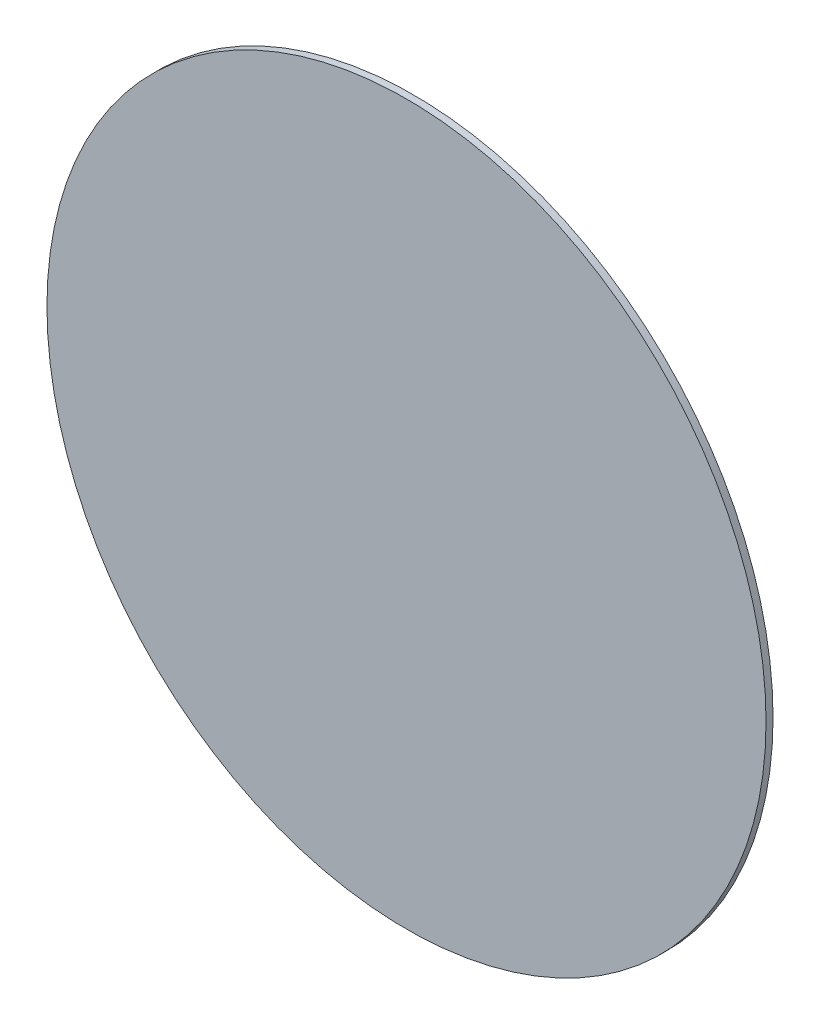
ISO-10303-21;
HEADER;
FILE_DESCRIPTION(('STEP AP214'),'2;1');
FILE_NAME('part.step','',(''),(''),'','','');
FILE_SCHEMA(('AUTOMOTIVE_DESIGN { 1 0 10303 214 1 1 1 1 }'));
ENDSEC;
DATA;
#1=APPLICATION_CONTEXT('core data for automotive mechanical design processes');
#2=APPLICATION_PROTOCOL_DEFINITION('international standard','automotive_design',2000,#1);
#3=PRODUCT_CONTEXT('',#1,'mechanical');
#4=PRODUCT('Part','Part','',(#3));
#5=PRODUCT_RELATED_PRODUCT_CATEGORY('part','',(#4));
#6=PRODUCT_DEFINITION_FORMATION('','',#4);
#7=PRODUCT_DEFINITION_CONTEXT('part definition',#1,'design');
#8=PRODUCT_DEFINITION('design','',#6,#7);
#9=PRODUCT_DEFINITION_SHAPE('','',#8);
#10=(LENGTH_UNIT() NAMED_UNIT(*) SI_UNIT(.MILLI.,.METRE.));
#11=(NAMED_UNIT(*) PLANE_ANGLE_UNIT() SI_UNIT($,.RADIAN.));
#12=(NAMED_UNIT(*) SI_UNIT($,.STERADIAN.) SOLID_ANGLE_UNIT());
#13=UNCERTAINTY_MEASURE_WITH_UNIT(LENGTH_MEASURE(1.E-05),#10,'distance_accuracy_value','');
#14=(GEOMETRIC_REPRESENTATION_CONTEXT(3) GLOBAL_UNCERTAINTY_ASSIGNED_CONTEXT((#13)) GLOBAL_UNIT_ASSIGNED_CONTEXT((#10,
#11,#12)) REPRESENTATION_CONTEXT('',''));
#15=CARTESIAN_POINT('',(0.,0.,0.));
#16=DIRECTION('',(0.,0.,1.));
#17=DIRECTION('',(1.,0.,0.));
#18=AXIS2_PLACEMENT_3D('',#15,#16,#17);
#19=CARTESIAN_POINT('',(0.,0.,2.6));
#20=DIRECTION('',(0.,0.,-1.));
#21=DIRECTION('',(-1.,0.,0.));
#22=AXIS2_PLACEMENT_3D('',#19,#20,#21);
#23=CYLINDRICAL_SURFACE('',#22,133.5);
#24=CARTESIAN_POINT('',(0.,0.,2.6));
#25=DIRECTION('',(0.,0.,1.));
#26=DIRECTION('',(1.,0.,0.));
#27=AXIS2_PLACEMENT_3D('',#24,#25,#26);
#28=CIRCLE('',#27,133.5);
#29=CARTESIAN_POINT('',(133.5,0.,2.6));
#30=VERTEX_POINT('',#29);
#31=EDGE_CURVE('E10',#30,#30,#28,.T.);
#32=ORIENTED_EDGE('',*,*,#31,.F.);
#33=EDGE_LOOP('',(#32));
#34=FACE_BOUND('',#33,.T.);
#35=CARTESIAN_POINT('',(0.,0.,0.));
#36=DIRECTION('',(0.,0.,1.));
#37=DIRECTION('',(1.,0.,0.));
#38=AXIS2_PLACEMENT_3D('',#35,#36,#37);
#39=CIRCLE('',#38,133.5);
#40=CARTESIAN_POINT('',(133.5,0.,0.));
#41=VERTEX_POINT('',#40);
#42=EDGE_CURVE('E35',#41,#41,#39,.T.);
#43=ORIENTED_EDGE('',*,*,#42,.T.);
#44=EDGE_LOOP('',(#43));
#45=FACE_BOUND('',#44,.T.);
#46=ADVANCED_FACE('F32',(#34,#45),#23,.T.);
#47=CARTESIAN_POINT('',(0.,0.,2.6));
#48=DIRECTION('',(0.,0.,1.));
#49=DIRECTION('',(1.,0.,0.));
#50=AXIS2_PLACEMENT_3D('',#47,#48,#49);
#51=PLANE('',#50);
#52=ORIENTED_EDGE('',*,*,#31,.T.);
#53=EDGE_LOOP('',(#52));
#54=FACE_BOUND('',#53,.T.);
#55=ADVANCED_FACE('F47',(#54),#51,.T.);
#56=CARTESIAN_POINT('',(0.,0.,0.));
#57=DIRECTION('',(0.,0.,1.));
#58=DIRECTION('',(1.,0.,0.));
#59=AXIS2_PLACEMENT_3D('',#56,#57,#58);
#60=PLANE('',#59);
#61=ORIENTED_EDGE('',*,*,#42,.F.);
#62=EDGE_LOOP('',(#61));
#63=FACE_BOUND('',#62,.T.);
#64=ADVANCED_FACE('F45',(#63),#60,.F.);
#65=CLOSED_SHELL('',(#46,#55,#64));
#66=MANIFOLD_SOLID_BREP('B2',#65);
#67=ADVANCED_BREP_SHAPE_REPRESENTATION('',(#18,#66),#14);
#68=SHAPE_DEFINITION_REPRESENTATION(#9,#67);
ENDSEC;
END-ISO-10303-21;
